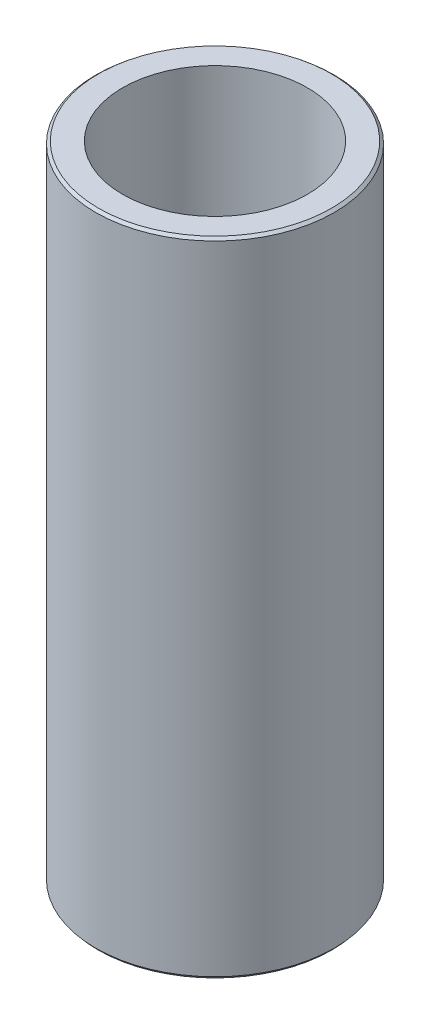
ISO-10303-21;
HEADER;
FILE_DESCRIPTION(('STEP AP214'),'2;1');
FILE_NAME('part.step','',(''),(''),'','','');
FILE_SCHEMA(('AUTOMOTIVE_DESIGN { 1 0 10303 214 1 1 1 1 }'));
ENDSEC;
DATA;
#1=APPLICATION_CONTEXT('core data for automotive mechanical design processes');
#2=APPLICATION_PROTOCOL_DEFINITION('international standard','automotive_design',2000,#1);
#3=PRODUCT_CONTEXT('',#1,'mechanical');
#4=PRODUCT('Part','Part','',(#3));
#5=PRODUCT_RELATED_PRODUCT_CATEGORY('part','',(#4));
#6=PRODUCT_DEFINITION_FORMATION('','',#4);
#7=PRODUCT_DEFINITION_CONTEXT('part definition',#1,'design');
#8=PRODUCT_DEFINITION('design','',#6,#7);
#9=PRODUCT_DEFINITION_SHAPE('','',#8);
#10=(LENGTH_UNIT() NAMED_UNIT(*) SI_UNIT(.MILLI.,.METRE.));
#11=(NAMED_UNIT(*) PLANE_ANGLE_UNIT() SI_UNIT($,.RADIAN.));
#12=(NAMED_UNIT(*) SI_UNIT($,.STERADIAN.) SOLID_ANGLE_UNIT());
#13=UNCERTAINTY_MEASURE_WITH_UNIT(LENGTH_MEASURE(1.E-05),#10,'distance_accuracy_value','');
#14=(GEOMETRIC_REPRESENTATION_CONTEXT(3) GLOBAL_UNCERTAINTY_ASSIGNED_CONTEXT((#13)) GLOBAL_UNIT_ASSIGNED_CONTEXT((#10,
#11,#12)) REPRESENTATION_CONTEXT('',''));
#15=CARTESIAN_POINT('',(0.,0.,0.));
#16=DIRECTION('',(0.,0.,1.));
#17=DIRECTION('',(1.,0.,0.));
#18=AXIS2_PLACEMENT_3D('',#15,#16,#17);
#19=CARTESIAN_POINT('',(0.,215.480341418233,0.));
#20=DIRECTION('',(0.,-1.,0.));
#21=DIRECTION('',(0.,0.,-1.));
#22=AXIS2_PLACEMENT_3D('',#19,#20,#21);
#23=CYLINDRICAL_SURFACE('',#22,40.);
#24=CARTESIAN_POINT('',(0.,214.697643765862,0.));
#25=DIRECTION('',(0.,1.,0.));
#26=DIRECTION('',(0.,0.,1.));
#27=AXIS2_PLACEMENT_3D('',#24,#25,#26);
#28=CIRCLE('',#27,40.);
#29=CARTESIAN_POINT('',(0.,214.697643765862,40.));
#30=VERTEX_POINT('',#29);
#31=EDGE_CURVE('E50',#30,#30,#28,.F.);
#32=ORIENTED_EDGE('',*,*,#31,.T.);
#33=EDGE_LOOP('',(#32));
#34=FACE_BOUND('',#33,.T.);
#35=CARTESIAN_POINT('',(0.,0.915731511811901,0.));
#36=DIRECTION('',(0.,1.,0.));
#37=DIRECTION('',(0.,0.,1.));
#38=AXIS2_PLACEMENT_3D('',#35,#36,#37);
#39=CIRCLE('',#38,40.);
#40=CARTESIAN_POINT('',(0.,0.915731511811901,40.));
#41=VERTEX_POINT('',#40);
#42=EDGE_CURVE('E51',#41,#41,#39,.T.);
#43=ORIENTED_EDGE('',*,*,#42,.T.);
#44=EDGE_LOOP('',(#43));
#45=FACE_BOUND('',#44,.T.);
#46=ADVANCED_FACE('F39',(#34,#45),#23,.T.);
#47=CARTESIAN_POINT('',(0.,215.480341418233,0.));
#48=DIRECTION('',(0.,1.,0.));
#49=DIRECTION('',(0.,0.,1.));
#50=AXIS2_PLACEMENT_3D('',#47,#48,#49);
#51=PLANE('',#50);
#52=CARTESIAN_POINT('',(0.,215.480341418233,0.));
#53=DIRECTION('',(0.,1.,0.));
#54=DIRECTION('',(0.,0.,1.));
#55=AXIS2_PLACEMENT_3D('',#52,#53,#54);
#56=CIRCLE('',#55,39.0842684881881);
#57=CARTESIAN_POINT('',(0.,215.480341418233,39.0842684881881));
#58=VERTEX_POINT('',#57);
#59=EDGE_CURVE('E54',#58,#58,#56,.T.);
#60=ORIENTED_EDGE('',*,*,#59,.T.);
#61=EDGE_LOOP('',(#60));
#62=FACE_BOUND('',#61,.T.);
#63=CARTESIAN_POINT('',(0.,215.480341418233,0.));
#64=DIRECTION('',(0.,1.,0.));
#65=DIRECTION('',(0.,0.,1.));
#66=AXIS2_PLACEMENT_3D('',#63,#64,#65);
#67=CIRCLE('',#66,31.007145560929);
#68=CARTESIAN_POINT('',(0.,215.480341418233,31.007145560929));
#69=VERTEX_POINT('',#68);
#70=EDGE_CURVE('E58',#69,#69,#67,.T.);
#71=ORIENTED_EDGE('',*,*,#70,.F.);
#72=EDGE_LOOP('',(#71));
#73=FACE_BOUND('',#72,.T.);
#74=ADVANCED_FACE('F69',(#62,#73),#51,.T.);
#75=CARTESIAN_POINT('',(0.,0.,0.));
#76=DIRECTION('',(0.,1.,0.));
#77=DIRECTION('',(0.,0.,1.));
#78=AXIS2_PLACEMENT_3D('',#75,#76,#77);
#79=PLANE('',#78);
#80=CARTESIAN_POINT('',(0.,0.,0.));
#81=DIRECTION('',(0.,1.,0.));
#82=DIRECTION('',(0.,0.,1.));
#83=AXIS2_PLACEMENT_3D('',#80,#81,#82);
#84=CIRCLE('',#83,39.2173023476297);
#85=CARTESIAN_POINT('',(0.,0.,39.2173023476297));
#86=VERTEX_POINT('',#85);
#87=EDGE_CURVE('E10',#86,#86,#84,.F.);
#88=ORIENTED_EDGE('',*,*,#87,.T.);
#89=EDGE_LOOP('',(#88));
#90=FACE_BOUND('',#89,.T.);
#91=CARTESIAN_POINT('',(0.,0.,0.));
#92=DIRECTION('',(0.,1.,0.));
#93=DIRECTION('',(0.,0.,1.));
#94=AXIS2_PLACEMENT_3D('',#91,#92,#93);
#95=CIRCLE('',#94,31.007145560929);
#96=CARTESIAN_POINT('',(0.,0.,31.007145560929));
#97=VERTEX_POINT('',#96);
#98=EDGE_CURVE('E63',#97,#97,#95,.T.);
#99=ORIENTED_EDGE('',*,*,#98,.T.);
#100=EDGE_LOOP('',(#99));
#101=FACE_BOUND('',#100,.T.);
#102=ADVANCED_FACE('F75',(#90,#101),#79,.F.);
#103=CARTESIAN_POINT('',(0.,215.480341418233,0.));
#104=DIRECTION('',(0.,-1.,0.));
#105=DIRECTION('',(0.,0.,-1.));
#106=AXIS2_PLACEMENT_3D('',#103,#104,#105);
#107=CYLINDRICAL_SURFACE('',#106,31.007145560929);
#108=ORIENTED_EDGE('',*,*,#70,.T.);
#109=EDGE_LOOP('',(#108));
#110=FACE_BOUND('',#109,.T.);
#111=ORIENTED_EDGE('',*,*,#98,.F.);
#112=EDGE_LOOP('',(#111));
#113=FACE_BOUND('',#112,.T.);
#114=ADVANCED_FACE('F70',(#110,#113),#107,.F.);
#115=CARTESIAN_POINT('',(0.,215.480341418233,0.));
#116=DIRECTION('',(0.,-1.,0.));
#117=DIRECTION('',(0.,0.,-1.));
#118=AXIS2_PLACEMENT_3D('',#115,#116,#117);
#119=CONICAL_SURFACE('',#118,39.0842684881881,0.863566152839897);
#120=ORIENTED_EDGE('',*,*,#31,.F.);
#121=EDGE_LOOP('',(#120));
#122=FACE_BOUND('',#121,.T.);
#123=ORIENTED_EDGE('',*,*,#59,.F.);
#124=EDGE_LOOP('',(#123));
#125=FACE_BOUND('',#124,.T.);
#126=ADVANCED_FACE('F81',(#122,#125),#119,.T.);
#127=CARTESIAN_POINT('',(0.,0.915731511811901,0.));
#128=DIRECTION('',(0.,1.,0.));
#129=DIRECTION('',(0.,0.,1.));
#130=AXIS2_PLACEMENT_3D('',#127,#128,#129);
#131=CONICAL_SURFACE('',#130,40.,0.707230173954994);
#132=ORIENTED_EDGE('',*,*,#87,.F.);
#133=EDGE_LOOP('',(#132));
#134=FACE_BOUND('',#133,.T.);
#135=ORIENTED_EDGE('',*,*,#42,.F.);
#136=EDGE_LOOP('',(#135));
#137=FACE_BOUND('',#136,.T.);
#138=ADVANCED_FACE('F45',(#134,#137),#131,.T.);
#139=CLOSED_SHELL('',(#46,#74,#102,#114,#126,#138));
#140=MANIFOLD_SOLID_BREP('B2',#139);
#141=ADVANCED_BREP_SHAPE_REPRESENTATION('',(#18,#140),#14);
#142=SHAPE_DEFINITION_REPRESENTATION(#9,#141);
ENDSEC;
END-ISO-10303-21;
